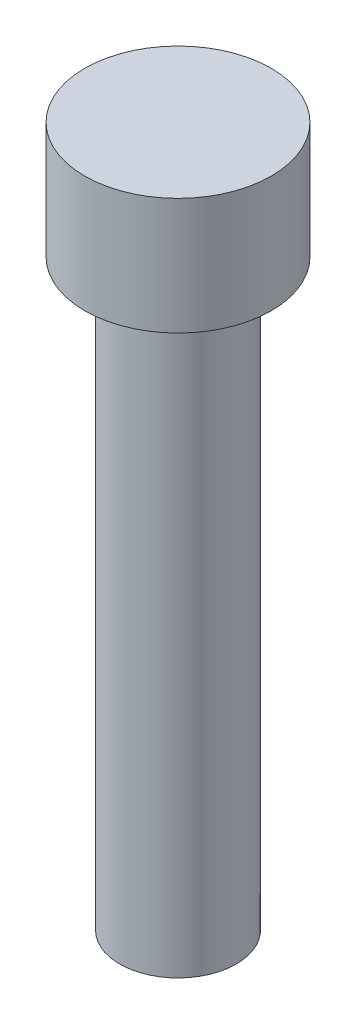
ISO-10303-21;
HEADER;
FILE_DESCRIPTION(('STEP AP214'),'2;1');
FILE_NAME('part.step','',(''),(''),'','','');
FILE_SCHEMA(('AUTOMOTIVE_DESIGN { 1 0 10303 214 1 1 1 1 }'));
ENDSEC;
DATA;
#1=APPLICATION_CONTEXT('core data for automotive mechanical design processes');
#2=APPLICATION_PROTOCOL_DEFINITION('international standard','automotive_design',2000,#1);
#3=PRODUCT_CONTEXT('',#1,'mechanical');
#4=PRODUCT('Part','Part','',(#3));
#5=PRODUCT_RELATED_PRODUCT_CATEGORY('part','',(#4));
#6=PRODUCT_DEFINITION_FORMATION('','',#4);
#7=PRODUCT_DEFINITION_CONTEXT('part definition',#1,'design');
#8=PRODUCT_DEFINITION('design','',#6,#7);
#9=PRODUCT_DEFINITION_SHAPE('','',#8);
#10=(LENGTH_UNIT() NAMED_UNIT(*) SI_UNIT(.MILLI.,.METRE.));
#11=(NAMED_UNIT(*) PLANE_ANGLE_UNIT() SI_UNIT($,.RADIAN.));
#12=(NAMED_UNIT(*) SI_UNIT($,.STERADIAN.) SOLID_ANGLE_UNIT());
#13=UNCERTAINTY_MEASURE_WITH_UNIT(LENGTH_MEASURE(1.E-05),#10,'distance_accuracy_value','');
#14=(GEOMETRIC_REPRESENTATION_CONTEXT(3) GLOBAL_UNCERTAINTY_ASSIGNED_CONTEXT((#13)) GLOBAL_UNIT_ASSIGNED_CONTEXT((#10,
#11,#12)) REPRESENTATION_CONTEXT('',''));
#15=CARTESIAN_POINT('',(0.,0.,0.));
#16=DIRECTION('',(0.,0.,1.));
#17=DIRECTION('',(1.,0.,0.));
#18=AXIS2_PLACEMENT_3D('',#15,#16,#17);
#19=CARTESIAN_POINT('',(2.5,0.,0.));
#20=DIRECTION('',(0.,-1.,0.));
#21=DIRECTION('',(0.,0.,-1.));
#22=AXIS2_PLACEMENT_3D('',#19,#20,#21);
#23=PLANE('',#22);
#24=CARTESIAN_POINT('',(0.,0.,0.));
#25=DIRECTION('',(0.,-1.,0.));
#26=DIRECTION('',(0.,0.,-1.));
#27=AXIS2_PLACEMENT_3D('',#24,#25,#26);
#28=CIRCLE('',#27,2.5);
#29=CARTESIAN_POINT('',(0.,0.,-2.5));
#30=VERTEX_POINT('',#29);
#31=EDGE_CURVE('E54',#30,#30,#28,.T.);
#32=ORIENTED_EDGE('',*,*,#31,.T.);
#33=EDGE_LOOP('',(#32));
#34=FACE_BOUND('',#33,.T.);
#35=ADVANCED_FACE('F37',(#34),#23,.T.);
#36=CARTESIAN_POINT('',(0.,30.,0.));
#37=DIRECTION('',(0.,1.,0.));
#38=DIRECTION('',(0.,0.,1.));
#39=AXIS2_PLACEMENT_3D('',#36,#37,#38);
#40=PLANE('',#39);
#41=CARTESIAN_POINT('',(0.,30.,0.));
#42=DIRECTION('',(0.,-1.,0.));
#43=DIRECTION('',(0.,0.,-1.));
#44=AXIS2_PLACEMENT_3D('',#41,#42,#43);
#45=CIRCLE('',#44,4.);
#46=CARTESIAN_POINT('',(0.,30.,-4.));
#47=VERTEX_POINT('',#46);
#48=EDGE_CURVE('E10',#47,#47,#45,.T.);
#49=ORIENTED_EDGE('',*,*,#48,.F.);
#50=EDGE_LOOP('',(#49));
#51=FACE_BOUND('',#50,.T.);
#52=ADVANCED_FACE('F73',(#51),#40,.T.);
#53=CARTESIAN_POINT('',(0.,0.,0.));
#54=DIRECTION('',(0.,-1.,0.));
#55=DIRECTION('',(0.,0.,-1.));
#56=AXIS2_PLACEMENT_3D('',#53,#54,#55);
#57=CYLINDRICAL_SURFACE('',#56,4.);
#58=ORIENTED_EDGE('',*,*,#48,.T.);
#59=EDGE_LOOP('',(#58));
#60=FACE_BOUND('',#59,.T.);
#61=CARTESIAN_POINT('',(0.,25.,0.));
#62=DIRECTION('',(0.,-1.,0.));
#63=DIRECTION('',(0.,0.,-1.));
#64=AXIS2_PLACEMENT_3D('',#61,#62,#63);
#65=CIRCLE('',#64,4.);
#66=CARTESIAN_POINT('',(0.,25.,-4.));
#67=VERTEX_POINT('',#66);
#68=EDGE_CURVE('E44',#67,#67,#65,.T.);
#69=ORIENTED_EDGE('',*,*,#68,.F.);
#70=EDGE_LOOP('',(#69));
#71=FACE_BOUND('',#70,.T.);
#72=ADVANCED_FACE('F70',(#60,#71),#57,.T.);
#73=CARTESIAN_POINT('',(4.,25.,0.));
#74=DIRECTION('',(0.,-1.,0.));
#75=DIRECTION('',(0.,0.,-1.));
#76=AXIS2_PLACEMENT_3D('',#73,#74,#75);
#77=PLANE('',#76);
#78=ORIENTED_EDGE('',*,*,#68,.T.);
#79=EDGE_LOOP('',(#78));
#80=FACE_BOUND('',#79,.T.);
#81=CARTESIAN_POINT('',(0.,25.,0.));
#82=DIRECTION('',(0.,-1.,0.));
#83=DIRECTION('',(0.,0.,-1.));
#84=AXIS2_PLACEMENT_3D('',#81,#82,#83);
#85=CIRCLE('',#84,2.5);
#86=CARTESIAN_POINT('',(0.,25.,-2.5));
#87=VERTEX_POINT('',#86);
#88=EDGE_CURVE('E49',#87,#87,#85,.T.);
#89=ORIENTED_EDGE('',*,*,#88,.F.);
#90=EDGE_LOOP('',(#89));
#91=FACE_BOUND('',#90,.T.);
#92=ADVANCED_FACE('F64',(#80,#91),#77,.T.);
#93=CARTESIAN_POINT('',(0.,0.,0.));
#94=DIRECTION('',(0.,-1.,0.));
#95=DIRECTION('',(0.,0.,-1.));
#96=AXIS2_PLACEMENT_3D('',#93,#94,#95);
#97=CYLINDRICAL_SURFACE('',#96,2.5);
#98=ORIENTED_EDGE('',*,*,#88,.T.);
#99=EDGE_LOOP('',(#98));
#100=FACE_BOUND('',#99,.T.);
#101=ORIENTED_EDGE('',*,*,#31,.F.);
#102=EDGE_LOOP('',(#101));
#103=FACE_BOUND('',#102,.T.);
#104=ADVANCED_FACE('F62',(#100,#103),#97,.T.);
#105=CLOSED_SHELL('',(#35,#52,#72,#92,#104));
#106=MANIFOLD_SOLID_BREP('B2',#105);
#107=ADVANCED_BREP_SHAPE_REPRESENTATION('',(#18,#106),#14);
#108=SHAPE_DEFINITION_REPRESENTATION(#9,#107);
ENDSEC;
END-ISO-10303-21;
